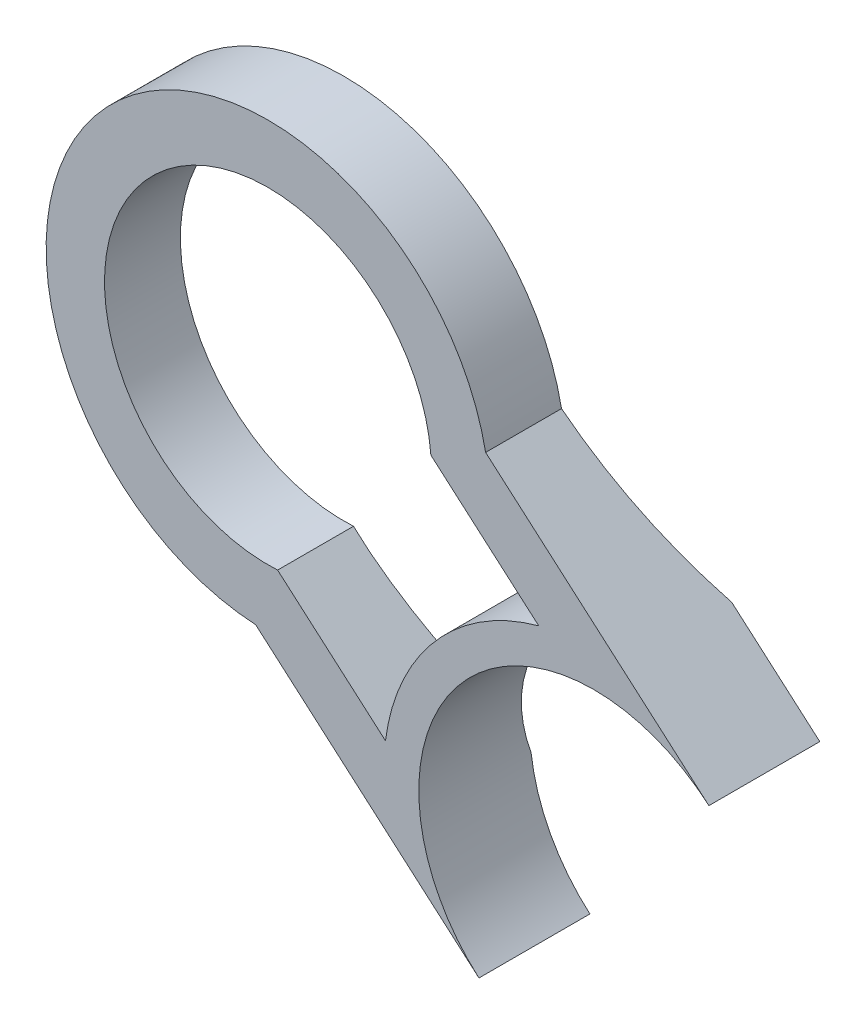
ISO-10303-21;
HEADER;
FILE_DESCRIPTION(('STEP AP214'),'2;1');
FILE_NAME('part.step','',(''),(''),'','','');
FILE_SCHEMA(('AUTOMOTIVE_DESIGN { 1 0 10303 214 1 1 1 1 }'));
ENDSEC;
DATA;
#1=APPLICATION_CONTEXT('core data for automotive mechanical design processes');
#2=APPLICATION_PROTOCOL_DEFINITION('international standard','automotive_design',2000,#1);
#3=PRODUCT_CONTEXT('',#1,'mechanical');
#4=PRODUCT('Part','Part','',(#3));
#5=PRODUCT_RELATED_PRODUCT_CATEGORY('part','',(#4));
#6=PRODUCT_DEFINITION_FORMATION('','',#4);
#7=PRODUCT_DEFINITION_CONTEXT('part definition',#1,'design');
#8=PRODUCT_DEFINITION('design','',#6,#7);
#9=PRODUCT_DEFINITION_SHAPE('','',#8);
#10=(LENGTH_UNIT() NAMED_UNIT(*) SI_UNIT(.MILLI.,.METRE.));
#11=(NAMED_UNIT(*) PLANE_ANGLE_UNIT() SI_UNIT($,.RADIAN.));
#12=(NAMED_UNIT(*) SI_UNIT($,.STERADIAN.) SOLID_ANGLE_UNIT());
#13=UNCERTAINTY_MEASURE_WITH_UNIT(LENGTH_MEASURE(1.E-05),#10,'distance_accuracy_value','');
#14=(GEOMETRIC_REPRESENTATION_CONTEXT(3) GLOBAL_UNCERTAINTY_ASSIGNED_CONTEXT((#13)) GLOBAL_UNIT_ASSIGNED_CONTEXT((#10,
#11,#12)) REPRESENTATION_CONTEXT('',''));
#15=CARTESIAN_POINT('',(0.,0.,0.));
#16=DIRECTION('',(0.,0.,1.));
#17=DIRECTION('',(1.,0.,0.));
#18=AXIS2_PLACEMENT_3D('',#15,#16,#17);
#19=CARTESIAN_POINT('',(-302.446135350573,188.678257863986,0.));
#20=DIRECTION('',(0.,0.,1.));
#21=DIRECTION('',(1.,0.,0.));
#22=AXIS2_PLACEMENT_3D('',#19,#20,#21);
#23=PLANE('',#22);
#24=DIRECTION('',(0.754380739835842,-0.656437125218195,0.));
#25=VECTOR('',#24,1.);
#26=CARTESIAN_POINT('',(-304.544217889635,150.736222472361,0.));
#27=LINE('',#26,#25);
#28=CARTESIAN_POINT('',(-281.385737412899,130.584480061919,0.));
#29=VERTEX_POINT('',#28);
#30=CARTESIAN_POINT('',(-266.298122616176,117.45573755755,0.));
#31=VERTEX_POINT('',#30);
#32=EDGE_CURVE('E214',#29,#31,#27,.T.);
#33=ORIENTED_EDGE('',*,*,#32,.F.);
#34=DIRECTION('',(0.656437125218195,0.754380739835841,0.));
#35=VECTOR('',#34,1.);
#36=CARTESIAN_POINT('',(-313.33683528877,93.8661228450643,0.));
#37=LINE('',#36,#35);
#38=CARTESIAN_POINT('',(-276.371004005775,136.347436105102,0.));
#39=VERTEX_POINT('',#38);
#40=EDGE_CURVE('E244',#29,#39,#37,.T.);
#41=ORIENTED_EDGE('',*,*,#40,.T.);
#42=CARTESIAN_POINT('',(-246.605008859633,140.087159752628,0.));
#43=DIRECTION('',(0.,0.,-1.));
#44=DIRECTION('',(1.,0.,0.));
#45=AXIS2_PLACEMENT_3D('',#42,#43,#44);
#46=CIRCLE('',#45,30.);
#47=EDGE_CURVE('E213',#31,#39,#46,.T.);
#48=ORIENTED_EDGE('',*,*,#47,.F.);
#49=EDGE_LOOP('',(#33,#41,#48));
#50=FACE_BOUND('',#49,.T.);
#51=ADVANCED_FACE('F33',(#50),#23,.F.);
#52=CARTESIAN_POINT('',(-302.446135350573,188.678257863986,19.));
#53=DIRECTION('',(0.,0.,1.));
#54=DIRECTION('',(1.,0.,0.));
#55=AXIS2_PLACEMENT_3D('',#52,#53,#54);
#56=PLANE('',#55);
#57=CARTESIAN_POINT('',(-302.446135350573,188.678257863986,19.));
#58=DIRECTION('',(0.,0.,1.));
#59=DIRECTION('',(1.,0.,0.));
#60=AXIS2_PLACEMENT_3D('',#57,#58,#59);
#61=CIRCLE('',#60,38.);
#62=CARTESIAN_POINT('',(-265.157990376498,195.999066862472,19.));
#63=VERTEX_POINT('',#62);
#64=CARTESIAN_POINT('',(-304.544217889635,150.736222472361,19.));
#65=VERTEX_POINT('',#64);
#66=EDGE_CURVE('E222',#63,#65,#61,.T.);
#67=ORIENTED_EDGE('',*,*,#66,.T.);
#68=DIRECTION('',(0.754380739835842,-0.656437125218195,0.));
#69=VECTOR('',#68,1.);
#70=CARTESIAN_POINT('',(-304.544217889635,150.736222472361,19.));
#71=LINE('',#70,#69);
#72=CARTESIAN_POINT('',(-266.298122616176,117.45573755755,19.));
#73=VERTEX_POINT('',#72);
#74=EDGE_CURVE('E261',#65,#73,#71,.T.);
#75=ORIENTED_EDGE('',*,*,#74,.T.);
#76=CARTESIAN_POINT('',(-246.605008859633,140.087159752628,19.));
#77=DIRECTION('',(0.,0.,-1.));
#78=DIRECTION('',(1.,0.,0.));
#79=AXIS2_PLACEMENT_3D('',#76,#77,#78);
#80=CIRCLE('',#79,30.);
#81=CARTESIAN_POINT('',(-226.91189510309,162.718581947706,19.));
#82=VERTEX_POINT('',#81);
#83=EDGE_CURVE('E263',#73,#82,#80,.T.);
#84=ORIENTED_EDGE('',*,*,#83,.T.);
#85=DIRECTION('',(-0.754380739835842,0.656437125218195,0.));
#86=VECTOR('',#85,1.);
#87=CARTESIAN_POINT('',(-265.157990376498,195.999066862472,19.));
#88=LINE('',#87,#86);
#89=EDGE_CURVE('E226',#82,#63,#88,.T.);
#90=ORIENTED_EDGE('',*,*,#89,.T.);
#91=EDGE_LOOP('',(#67,#75,#84,#90));
#92=FACE_BOUND('',#91,.T.);
#93=DIRECTION('',(0.754380739835842,-0.656437125218195,0.));
#94=VECTOR('',#93,1.);
#95=CARTESIAN_POINT('',(-300.792094779922,160.727155027234,19.));
#96=LINE('',#95,#94);
#97=CARTESIAN_POINT('',(-300.792094779922,160.727155027234,19.));
#98=VERTEX_POINT('',#97);
#99=CARTESIAN_POINT('',(-282.314825505171,144.648847504114,19.));
#100=VERTEX_POINT('',#99);
#101=EDGE_CURVE('E281',#98,#100,#96,.T.);
#102=ORIENTED_EDGE('',*,*,#101,.F.);
#103=CARTESIAN_POINT('',(-302.446135350573,188.678257863986,19.));
#104=DIRECTION('',(0.,0.,1.));
#105=DIRECTION('',(1.,0.,0.));
#106=AXIS2_PLACEMENT_3D('',#103,#104,#105);
#107=CIRCLE('',#106,28.);
#108=CARTESIAN_POINT('',(-274.534609771158,190.902384620636,19.));
#109=VERTEX_POINT('',#108);
#110=EDGE_CURVE('E132',#109,#98,#107,.T.);
#111=ORIENTED_EDGE('',*,*,#110,.F.);
#112=DIRECTION('',(-0.754380739835842,0.656437125218194,0.));
#113=VECTOR('',#112,1.);
#114=CARTESIAN_POINT('',(-274.534609771158,190.902384620636,19.));
#115=LINE('',#114,#113);
#116=CARTESIAN_POINT('',(-256.057340496444,174.824077097547,19.));
#117=VERTEX_POINT('',#116);
#118=EDGE_CURVE('E246',#117,#109,#115,.T.);
#119=ORIENTED_EDGE('',*,*,#118,.F.);
#120=CARTESIAN_POINT('',(-246.605008859633,140.087159752628,19.));
#121=DIRECTION('',(0.,0.,-1.));
#122=DIRECTION('',(1.,0.,0.));
#123=AXIS2_PLACEMENT_3D('',#120,#121,#122);
#124=CIRCLE('',#123,36.);
#125=EDGE_CURVE('E252',#100,#117,#124,.T.);
#126=ORIENTED_EDGE('',*,*,#125,.F.);
#127=EDGE_LOOP('',(#102,#111,#119,#126));
#128=FACE_BOUND('',#127,.T.);
#129=ADVANCED_FACE('F193',(#92,#128),#56,.T.);
#130=CARTESIAN_POINT('',(-247.014243306931,170.084368408887,0.));
#131=VERTEX_POINT('',#130);
#132=CARTESIAN_POINT('',(-226.91189510309,162.718581947706,0.));
#133=VERTEX_POINT('',#132);
#134=EDGE_CURVE('E208',#131,#133,#46,.T.);
#135=ORIENTED_EDGE('',*,*,#134,.F.);
#136=CARTESIAN_POINT('',(-241.999509899807,175.84732445207,0.));
#137=VERTEX_POINT('',#136);
#138=EDGE_CURVE('E138',#131,#137,#37,.T.);
#139=ORIENTED_EDGE('',*,*,#138,.T.);
#140=DIRECTION('',(-0.754380739835842,0.656437125218195,0.));
#141=VECTOR('',#140,1.);
#142=CARTESIAN_POINT('',(-265.157990376498,195.999066862472,0.));
#143=LINE('',#142,#141);
#144=EDGE_CURVE('E210',#133,#137,#143,.T.);
#145=ORIENTED_EDGE('',*,*,#144,.F.);
#146=EDGE_LOOP('',(#135,#139,#145));
#147=FACE_BOUND('',#146,.T.);
#148=ADVANCED_FACE('F191',(#147),#23,.F.);
#149=CARTESIAN_POINT('',(-302.446135350573,188.678257863986,19.));
#150=DIRECTION('',(0.,0.,-1.));
#151=DIRECTION('',(-1.,0.,0.));
#152=AXIS2_PLACEMENT_3D('',#149,#150,#151);
#153=CYLINDRICAL_SURFACE('',#152,38.);
#154=DIRECTION('',(0.,0.,-1.));
#155=VECTOR('',#154,1.);
#156=CARTESIAN_POINT('',(-265.157990376498,195.999066862472,19.));
#157=LINE('',#156,#155);
#158=CARTESIAN_POINT('',(-265.157990376498,195.999066862472,5.99910467004484));
#159=VERTEX_POINT('',#158);
#160=EDGE_CURVE('E223',#63,#159,#157,.T.);
#161=ORIENTED_EDGE('',*,*,#160,.T.);
#162=CARTESIAN_POINT('',(-265.157990376498,195.999066862472,5.99910467004484));
#163=CARTESIAN_POINT('',(-265.15900618024,196.004240803965,5.99925436425014));
#164=CARTESIAN_POINT('',(-265.160023062062,196.009414540147,5.99940382218238));
#165=CARTESIAN_POINT('',(-265.162058981863,196.019761601889,5.99970226550077));
#166=CARTESIAN_POINT('',(-265.163078019842,196.024934927448,5.99985125088691));
#167=CARTESIAN_POINT('',(-265.1640981359,196.030108047697,6.00000000000001));
#168=B_SPLINE_CURVE_WITH_KNOTS('',3,(#162,#163,#164,#165,#166,#167),.UNSPECIFIED.,.F.,.F.,(4,2,
4),(0.,0.0158245186830743,0.0316490373661981),.UNSPECIFIED.);
#169=CARTESIAN_POINT('',(-265.1640981359,196.030108047697,6.));
#170=VERTEX_POINT('',#169);
#171=EDGE_CURVE('E49',#159,#170,#168,.T.);
#172=ORIENTED_EDGE('',*,*,#171,.T.);
#173=CARTESIAN_POINT('',(-302.446135350573,188.678257863986,6.));
#174=DIRECTION('',(0.,0.,1.));
#175=DIRECTION('',(1.,0.,0.));
#176=AXIS2_PLACEMENT_3D('',#173,#174,#175);
#177=CIRCLE('',#176,38.);
#178=CARTESIAN_POINT('',(-304.575805272061,150.73798235068,6.));
#179=VERTEX_POINT('',#178);
#180=EDGE_CURVE('E135',#170,#179,#177,.T.);
#181=ORIENTED_EDGE('',*,*,#180,.T.);
#182=CARTESIAN_POINT('',(-304.575805272061,150.73798235068,6.00000000000001));
#183=CARTESIAN_POINT('',(-304.570540817068,150.737686845414,5.99985125088729));
#184=CARTESIAN_POINT('',(-304.565276307702,150.737392436254,5.99970226550151));
#185=CARTESIAN_POINT('',(-304.554747180227,150.736805810147,5.99940382218386));
#186=CARTESIAN_POINT('',(-304.549482562117,150.736513593201,5.99925436425197));
#187=CARTESIAN_POINT('',(-304.544217889635,150.736222472361,5.99910467004704));
#188=B_SPLINE_CURVE_WITH_KNOTS('',3,(#182,#183,#184,#185,#186,#187),.UNSPECIFIED.,.F.,.F.,(4,2,
4),(0.,0.0158245186443797,0.0316490372887707),.UNSPECIFIED.);
#189=CARTESIAN_POINT('',(-304.544217889635,150.736222472361,5.99910467004704));
#190=VERTEX_POINT('',#189);
#191=EDGE_CURVE('E121',#179,#190,#188,.T.);
#192=ORIENTED_EDGE('',*,*,#191,.T.);
#193=DIRECTION('',(0.,0.,-1.));
#194=VECTOR('',#193,1.);
#195=CARTESIAN_POINT('',(-304.544217889635,150.736222472361,19.));
#196=LINE('',#195,#194);
#197=EDGE_CURVE('E231',#65,#190,#196,.T.);
#198=ORIENTED_EDGE('',*,*,#197,.F.);
#199=ORIENTED_EDGE('',*,*,#66,.F.);
#200=EDGE_LOOP('',(#161,#172,#181,#192,#198,#199));
#201=FACE_BOUND('',#200,.T.);
#202=ADVANCED_FACE('F35',(#201),#153,.T.);
#203=CARTESIAN_POINT('',(-304.544217889635,150.736222472361,19.));
#204=DIRECTION('',(0.656437125218195,0.754380739835842,0.));
#205=DIRECTION('',(-0.754380739835842,0.656437125218195,0.));
#206=AXIS2_PLACEMENT_3D('',#203,#204,#205);
#207=PLANE('',#206);
#208=ORIENTED_EDGE('',*,*,#197,.T.);
#209=CARTESIAN_POINT('',(-307.255298760397,153.09531522097,-93.9362980755048));
#210=DIRECTION('',(0.656437125218195,0.754380739835842,0.));
#211=DIRECTION('',(-0.754380739835842,0.656437125218195,0.));
#212=AXIS2_PLACEMENT_3D('',#209,#210,#211);
#213=CIRCLE('',#212,100.);
#214=EDGE_CURVE('E127',#190,#29,#213,.T.);
#215=ORIENTED_EDGE('',*,*,#214,.T.);
#216=ORIENTED_EDGE('',*,*,#32,.T.);
#217=DIRECTION('',(0.,0.,-1.));
#218=VECTOR('',#217,1.);
#219=CARTESIAN_POINT('',(-266.298122616176,117.45573755755,19.));
#220=LINE('',#219,#218);
#221=EDGE_CURVE('E228',#73,#31,#220,.T.);
#222=ORIENTED_EDGE('',*,*,#221,.F.);
#223=ORIENTED_EDGE('',*,*,#74,.F.);
#224=EDGE_LOOP('',(#208,#215,#216,#222,#223));
#225=FACE_BOUND('',#224,.T.);
#226=ADVANCED_FACE('F183',(#225),#207,.F.);
#227=CARTESIAN_POINT('',(-246.605008859633,140.087159752628,19.));
#228=DIRECTION('',(0.,0.,-1.));
#229=DIRECTION('',(-1.,0.,0.));
#230=AXIS2_PLACEMENT_3D('',#227,#228,#229);
#231=CYLINDRICAL_SURFACE('',#230,30.);
#232=ORIENTED_EDGE('',*,*,#47,.T.);
#233=CARTESIAN_POINT('',(-276.371004005775,136.347436105102,0.));
#234=CARTESIAN_POINT('',(-276.420404068987,136.740570521399,0.107816812486937));
#235=CARTESIAN_POINT('',(-276.462110881207,137.135563648663,0.212378324183237));
#236=CARTESIAN_POINT('',(-276.529890759937,137.928530972936,0.415086595254615));
#237=CARTESIAN_POINT('',(-276.55596362865,138.326505207597,0.513233273456679));
#238=CARTESIAN_POINT('',(-276.592227367026,139.124693975806,0.703206328310026));
#239=CARTESIAN_POINT('',(-276.60241801517,139.524908540524,0.795032616789777));
#240=CARTESIAN_POINT('',(-276.606732212244,140.326768331182,0.972471284890888));
#241=CARTESIAN_POINT('',(-276.600855855945,140.72841354867,1.05808370116089));
#242=CARTESIAN_POINT('',(-276.558901548872,141.933779549287,1.30567028952324));
#243=CARTESIAN_POINT('',(-276.498532989239,142.738681914317,1.45857145547387));
#244=CARTESIAN_POINT('',(-276.312348417463,144.344837811838,1.74118617700598));
#245=CARTESIAN_POINT('',(-276.186534968094,145.146091485971,1.87090064029396));
#246=CARTESIAN_POINT('',(-275.869419628533,146.739577784972,2.10852354954709));
#247=CARTESIAN_POINT('',(-275.678061521042,147.531802060678,2.21641314967685));
#248=CARTESIAN_POINT('',(-275.230644798505,149.100382853274,2.41149119947145));
#249=CARTESIAN_POINT('',(-274.974584609877,149.876738983748,2.49867914556336));
#250=CARTESIAN_POINT('',(-274.399247898372,151.407433870058,2.65350636593513));
#251=CARTESIAN_POINT('',(-274.079988197619,152.16177842365,2.7211508304406));
#252=CARTESIAN_POINT('',(-273.380201401439,153.642969306922,2.83794284262997));
#253=CARTESIAN_POINT('',(-272.999674999074,154.369815947551,2.88709059953158));
#254=CARTESIAN_POINT('',(-272.182046972452,155.786864634177,2.96748621888479));
#255=CARTESIAN_POINT('',(-271.745254574649,156.477239852892,2.99882719416758));
#256=CARTESIAN_POINT('',(-270.816524705123,157.820438673348,3.04454946092529));
#257=CARTESIAN_POINT('',(-270.324587250293,158.473262286592,3.0589307575954));
#258=CARTESIAN_POINT('',(-269.288926561116,159.736771362618,3.07099112969979));
#259=CARTESIAN_POINT('',(-268.745195977046,160.347450823652,3.06866783116808));
#260=CARTESIAN_POINT('',(-267.609871433367,161.52224836747,3.04727160736631));
#261=CARTESIAN_POINT('',(-267.018277531021,162.086366505957,3.02819870213494));
#262=CARTESIAN_POINT('',(-265.790765794939,163.16474494289,2.97293231844578));
#263=CARTESIAN_POINT('',(-265.154796171933,163.678945252966,2.93671854064228));
#264=CARTESIAN_POINT('',(-263.843825751209,164.653196141764,2.84654389828636));
#265=CARTESIAN_POINT('',(-263.168824602583,165.113246233542,2.79258287415924));
#266=CARTESIAN_POINT('',(-261.7846444641,165.976231099445,2.66603333383554));
#267=CARTESIAN_POINT('',(-261.075455984382,166.379149891069,2.59343962103587));
#268=CARTESIAN_POINT('',(-259.628491065014,167.125122267381,2.42857674490282));
#269=CARTESIAN_POINT('',(-258.890715708656,167.468178117855,2.33630832654201));
#270=CARTESIAN_POINT('',(-257.392576936693,168.092276694933,2.13095166004637));
#271=CARTESIAN_POINT('',(-256.632223479261,168.373346313104,2.01787247948555));
#272=CARTESIAN_POINT('',(-255.094446668196,168.872275813097,1.76960606610792));
#273=CARTESIAN_POINT('',(-254.317020912907,169.09012673952,1.63441570531483));
#274=CARTESIAN_POINT('',(-252.752683098649,169.461492268848,1.34098240453188));
#275=CARTESIAN_POINT('',(-251.965788952377,169.615113191806,1.18277814945151));
#276=CARTESIAN_POINT('',(-250.387733901849,169.858416378688,0.842114054314688));
#277=CARTESIAN_POINT('',(-249.59657566467,169.948134782753,0.659667993629153));
#278=CARTESIAN_POINT('',(-248.507088354589,170.028307681825,0.390824807373272));
#279=CARTESIAN_POINT('',(-248.20788182976,170.045804318502,0.315157673626885));
#280=CARTESIAN_POINT('',(-247.610396330268,170.07179652638,0.160272287439845));
#281=CARTESIAN_POINT('',(-247.312116664073,170.08030330195,0.0810585839329725));
#282=CARTESIAN_POINT('',(-247.014243306931,170.084368408887,0.));
#283=B_SPLINE_CURVE_WITH_KNOTS('',3,(#233,#234,#235,#236,#237,#238,#239,#240,#241,#242,#243,
#244,#245,#246,#247,#248,#249,#250,#251,#252,#253,#254,#255,#256,#257,#258,#259,#260,#261,#262,
#263,#264,#265,#266,#267,#268,#269,#270,#271,#272,#273,#274,#275,#276,#277,#278,#279,#280,#281,
#282),.UNSPECIFIED.,.F.,.F.,(4,2,2,2,2,2,2,2,2,2,2,2,2,2,2,2,2,2,2,2,2,2,2,2,4),(0.,
1.23180744057999,2.46363046537952,3.69547067103728,4.92730361086463,7.3886586699541,
9.8499173514953,12.3132923494452,14.7767272634723,17.2395073524875,19.7022595839677,
22.1520125149122,24.6017646954344,27.0518650282611,29.5019624298692,31.9549686851669,
34.4079969973176,36.861710196781,39.3153305041554,41.7678842511226,44.2207852511904,
46.6696097287165,49.1170481687683,50.0442955879666,50.9703859794601),.UNSPECIFIED.);
#284=EDGE_CURVE('E171',#39,#131,#283,.T.);
#285=ORIENTED_EDGE('',*,*,#284,.T.);
#286=ORIENTED_EDGE('',*,*,#134,.T.);
#287=DIRECTION('',(0.,0.,-1.));
#288=VECTOR('',#287,1.);
#289=CARTESIAN_POINT('',(-226.91189510309,162.718581947706,19.));
#290=LINE('',#289,#288);
#291=EDGE_CURVE('E225',#82,#133,#290,.T.);
#292=ORIENTED_EDGE('',*,*,#291,.F.);
#293=ORIENTED_EDGE('',*,*,#83,.F.);
#294=ORIENTED_EDGE('',*,*,#221,.T.);
#295=EDGE_LOOP('',(#232,#285,#286,#292,#293,#294));
#296=FACE_BOUND('',#295,.T.);
#297=ADVANCED_FACE('F178',(#296),#231,.F.);
#298=CARTESIAN_POINT('',(-265.157990376498,195.999066862472,19.));
#299=DIRECTION('',(-0.656437125218195,-0.754380739835842,0.));
#300=DIRECTION('',(0.754380739835842,-0.656437125218195,0.));
#301=AXIS2_PLACEMENT_3D('',#298,#299,#300);
#302=PLANE('',#301);
#303=ORIENTED_EDGE('',*,*,#144,.T.);
#304=CARTESIAN_POINT('',(-267.869071247305,198.35815961112,-93.9362980755048));
#305=DIRECTION('',(-0.656437125218195,-0.754380739835842,0.));
#306=DIRECTION('',(0.754380739835842,-0.656437125218195,0.));
#307=AXIS2_PLACEMENT_3D('',#304,#305,#306);
#308=CIRCLE('',#307,100.);
#309=EDGE_CURVE('E270',#137,#159,#308,.T.);
#310=ORIENTED_EDGE('',*,*,#309,.T.);
#311=ORIENTED_EDGE('',*,*,#160,.F.);
#312=ORIENTED_EDGE('',*,*,#89,.F.);
#313=ORIENTED_EDGE('',*,*,#291,.T.);
#314=EDGE_LOOP('',(#303,#310,#311,#312,#313));
#315=FACE_BOUND('',#314,.T.);
#316=ADVANCED_FACE('F182',(#315),#302,.F.);
#317=CARTESIAN_POINT('',(-302.446135350573,188.678257863986,19.));
#318=DIRECTION('',(0.,0.,-1.));
#319=DIRECTION('',(-1.,0.,0.));
#320=AXIS2_PLACEMENT_3D('',#317,#318,#319);
#321=CYLINDRICAL_SURFACE('',#320,28.);
#322=CARTESIAN_POINT('',(-302.446135350573,188.678257863986,6.));
#323=DIRECTION('',(0.,0.,1.));
#324=DIRECTION('',(1.,0.,0.));
#325=AXIS2_PLACEMENT_3D('',#322,#323,#324);
#326=CIRCLE('',#325,28.);
#327=CARTESIAN_POINT('',(-274.534609771158,190.902384620636,6.));
#328=VERTEX_POINT('',#327);
#329=CARTESIAN_POINT('',(-300.792094779922,160.727155027234,6.));
#330=VERTEX_POINT('',#329);
#331=EDGE_CURVE('E145',#328,#330,#326,.T.);
#332=ORIENTED_EDGE('',*,*,#331,.F.);
#333=DIRECTION('',(0.,0.,-1.));
#334=VECTOR('',#333,1.);
#335=CARTESIAN_POINT('',(-274.534609771158,190.902384620636,19.));
#336=LINE('',#335,#334);
#337=EDGE_CURVE('E241',#109,#328,#336,.T.);
#338=ORIENTED_EDGE('',*,*,#337,.F.);
#339=ORIENTED_EDGE('',*,*,#110,.T.);
#340=DIRECTION('',(0.,0.,-1.));
#341=VECTOR('',#340,1.);
#342=CARTESIAN_POINT('',(-300.792094779922,160.727155027234,19.));
#343=LINE('',#342,#341);
#344=EDGE_CURVE('E217',#98,#330,#343,.T.);
#345=ORIENTED_EDGE('',*,*,#344,.T.);
#346=EDGE_LOOP('',(#332,#338,#339,#345));
#347=FACE_BOUND('',#346,.T.);
#348=ADVANCED_FACE('F240',(#347),#321,.F.);
#349=CARTESIAN_POINT('',(-300.792094779922,160.727155027234,19.));
#350=DIRECTION('',(0.656437125218195,0.754380739835842,0.));
#351=DIRECTION('',(-0.754380739835842,0.656437125218195,0.));
#352=AXIS2_PLACEMENT_3D('',#349,#350,#351);
#353=PLANE('',#352);
#354=CARTESIAN_POINT('',(-300.690927508215,160.639122619328,-93.9362980755048));
#355=DIRECTION('',(0.656437125218195,0.754380739835842,0.));
#356=DIRECTION('',(-0.754380739835842,0.656437125218195,0.));
#357=AXIS2_PLACEMENT_3D('',#354,#355,#356);
#358=CIRCLE('',#357,100.);
#359=CARTESIAN_POINT('',(-297.99869420836,158.296430402454,6.));
#360=VERTEX_POINT('',#359);
#361=CARTESIAN_POINT('',(-282.314825505171,144.648847504114,3.05148454124279));
#362=VERTEX_POINT('',#361);
#363=EDGE_CURVE('E143',#360,#362,#358,.T.);
#364=ORIENTED_EDGE('',*,*,#363,.F.);
#365=DIRECTION('',(0.754380739835842,-0.656437125218195,0.));
#366=VECTOR('',#365,1.);
#367=CARTESIAN_POINT('',(-300.792094779922,160.727155027234,6.));
#368=LINE('',#367,#366);
#369=EDGE_CURVE('E137',#330,#360,#368,.T.);
#370=ORIENTED_EDGE('',*,*,#369,.F.);
#371=ORIENTED_EDGE('',*,*,#344,.F.);
#372=ORIENTED_EDGE('',*,*,#101,.T.);
#373=DIRECTION('',(0.,0.,-1.));
#374=VECTOR('',#373,1.);
#375=CARTESIAN_POINT('',(-282.314825505171,144.648847504114,19.));
#376=LINE('',#375,#374);
#377=EDGE_CURVE('E250',#100,#362,#376,.T.);
#378=ORIENTED_EDGE('',*,*,#377,.T.);
#379=EDGE_LOOP('',(#364,#370,#371,#372,#378));
#380=FACE_BOUND('',#379,.T.);
#381=ADVANCED_FACE('F288',(#380),#353,.T.);
#382=CARTESIAN_POINT('',(-246.605008859633,140.087159752628,19.));
#383=DIRECTION('',(0.,0.,-1.));
#384=DIRECTION('',(-1.,0.,0.));
#385=AXIS2_PLACEMENT_3D('',#382,#383,#384);
#386=CYLINDRICAL_SURFACE('',#385,36.);
#387=CARTESIAN_POINT('',(-282.314825505171,144.648847504114,3.05148454124279));
#388=CARTESIAN_POINT('',(-282.252690647393,145.13532021141,3.11991375546108));
#389=CARTESIAN_POINT('',(-282.180541224999,145.620964543925,3.18509318641947));
#390=CARTESIAN_POINT('',(-282.016287695116,146.589659856878,3.30924582388755));
#391=CARTESIAN_POINT('',(-281.924183805454,147.072710865565,3.36821909813454));
#392=CARTESIAN_POINT('',(-281.720105445487,148.035241613711,3.48024819586014));
#393=CARTESIAN_POINT('',(-281.608133122121,148.514721733204,3.53330465768868));
#394=CARTESIAN_POINT('',(-281.364466936414,149.469204880493,3.6337893074208));
#395=CARTESIAN_POINT('',(-281.232773057065,149.944207904426,3.68121749047046));
#396=CARTESIAN_POINT('',(-280.808618165697,151.360267735096,3.81539305866127));
#397=CARTESIAN_POINT('',(-280.486845742034,152.293499231394,3.89416048072073));
#398=CARTESIAN_POINT('',(-279.767211772547,154.131472226265,4.03236678578825));
#399=CARTESIAN_POINT('',(-279.369350078363,155.036213669284,4.09180563110883));
#400=CARTESIAN_POINT('',(-278.500064774102,156.810844308492,4.19307919261234));
#401=CARTESIAN_POINT('',(-278.028631702664,157.680729003956,4.23491164203169));
#402=CARTESIAN_POINT('',(-277.01545260431,159.379200286537,4.30225681299821));
#403=CARTESIAN_POINT('',(-276.473705761457,160.20778639426,4.32776934514497));
#404=CARTESIAN_POINT('',(-275.323614461152,161.817793371388,4.36331331601164));
#405=CARTESIAN_POINT('',(-274.715266434967,162.599211709887,4.37334392471852));
#406=CARTESIAN_POINT('',(-273.43626028841,164.109295102674,4.37826010131999));
#407=CARTESIAN_POINT('',(-272.765603374181,164.837961177627,4.37314596231977));
#408=CARTESIAN_POINT('',(-271.363148831228,166.240999604469,4.34753533447798));
#409=CARTESIAN_POINT('',(-270.631058365937,166.915077852105,4.32696096253735));
#410=CARTESIAN_POINT('',(-269.113902208389,168.200110716841,4.26964531430273));
#411=CARTESIAN_POINT('',(-268.328832169123,168.811060143744,4.23290271002563));
#412=CARTESIAN_POINT('',(-266.711996279832,169.965164397621,4.14210250609647));
#413=CARTESIAN_POINT('',(-265.880257065729,170.508357336578,4.08805470193852));
#414=CARTESIAN_POINT('',(-264.175972971194,171.523513350112,3.96103816246416));
#415=CARTESIAN_POINT('',(-263.303440708014,171.995498260832,3.8880752462531));
#416=CARTESIAN_POINT('',(-261.902794592892,172.680130853179,3.75677149334598));
#417=CARTESIAN_POINT('',(-261.386042958725,172.917694961812,3.70541176909585));
#418=CARTESIAN_POINT('',(-260.34254117269,173.367829114353,3.59538350551412));
#419=CARTESIAN_POINT('',(-259.815791910021,173.580401369073,3.53671561361983));
#420=CARTESIAN_POINT('',(-258.75458171227,173.979764941106,3.41174933420242));
#421=CARTESIAN_POINT('',(-258.220136017955,174.166601070065,3.34546458803141));
#422=CARTESIAN_POINT('',(-257.143882675437,174.514654149743,3.20471789072638));
#423=CARTESIAN_POINT('',(-256.602073268002,174.675864857323,3.13025395433973));
#424=CARTESIAN_POINT('',(-256.057340496444,174.824077097547,3.05148454124279));
#425=B_SPLINE_CURVE_WITH_KNOTS('',3,(#387,#388,#389,#390,#391,#392,#393,#394,#395,#396,#397,
#398,#399,#400,#401,#402,#403,#404,#405,#406,#407,#408,#409,#410,#411,#412,#413,#414,#415,#416,
#417,#418,#419,#420,#421,#422,#423,#424),.UNSPECIFIED.,.F.,.F.,(4,2,2,2,2,2,2,2,2,2,2,2,2,2,2,2,
2,2,4),(0.,1.4854035761468,2.97079093812638,4.4560178900654,5.94124612287713,8.90824539603867,
11.8752504543156,14.842637387639,17.8100587582772,20.7776392120457,23.7451622328624,
26.7277356366941,29.7105540609184,32.6916870565252,35.6719040129861,37.3844874569357,
39.0969192892988,40.8063306975441,42.5161579347279),.UNSPECIFIED.);
#426=CARTESIAN_POINT('',(-256.057340496444,174.824077097547,3.05148454124281));
#427=VERTEX_POINT('',#426);
#428=EDGE_CURVE('E141',#362,#427,#425,.T.);
#429=ORIENTED_EDGE('',*,*,#428,.F.);
#430=ORIENTED_EDGE('',*,*,#377,.F.);
#431=ORIENTED_EDGE('',*,*,#125,.T.);
#432=DIRECTION('',(0.,0.,-1.));
#433=VECTOR('',#432,1.);
#434=CARTESIAN_POINT('',(-256.057340496444,174.824077097547,19.));
#435=LINE('',#434,#433);
#436=EDGE_CURVE('E247',#117,#427,#435,.T.);
#437=ORIENTED_EDGE('',*,*,#436,.T.);
#438=EDGE_LOOP('',(#429,#430,#431,#437));
#439=FACE_BOUND('',#438,.T.);
#440=ADVANCED_FACE('F155',(#439),#386,.T.);
#441=CARTESIAN_POINT('',(-274.534609771158,190.902384620636,19.));
#442=DIRECTION('',(-0.656437125218194,-0.754380739835842,0.));
#443=DIRECTION('',(0.754380739835842,-0.656437125218194,0.));
#444=AXIS2_PLACEMENT_3D('',#441,#442,#443);
#445=PLANE('',#444);
#446=CARTESIAN_POINT('',(-274.433442499487,190.814352212762,-93.9362980755048));
#447=DIRECTION('',(-0.656437125218194,-0.754380739835842,0.));
#448=DIRECTION('',(0.754380739835842,-0.656437125218194,0.));
#449=AXIS2_PLACEMENT_3D('',#446,#447,#448);
#450=CIRCLE('',#449,100.);
#451=CARTESIAN_POINT('',(-271.741209199632,188.471659995887,6.));
#452=VERTEX_POINT('',#451);
#453=EDGE_CURVE('E11',#427,#452,#450,.T.);
#454=ORIENTED_EDGE('',*,*,#453,.F.);
#455=ORIENTED_EDGE('',*,*,#436,.F.);
#456=ORIENTED_EDGE('',*,*,#118,.T.);
#457=ORIENTED_EDGE('',*,*,#337,.T.);
#458=DIRECTION('',(-0.754380739835842,0.656437125218194,0.));
#459=VECTOR('',#458,1.);
#460=CARTESIAN_POINT('',(-274.534609771158,190.902384620636,6.));
#461=LINE('',#460,#459);
#462=EDGE_CURVE('E42',#452,#328,#461,.T.);
#463=ORIENTED_EDGE('',*,*,#462,.F.);
#464=EDGE_LOOP('',(#454,#455,#456,#457,#463));
#465=FACE_BOUND('',#464,.T.);
#466=ADVANCED_FACE('F162',(#465),#445,.T.);
#467=CARTESIAN_POINT('',(-339.206396636268,116.376958004115,-93.9362980755048));
#468=DIRECTION('',(0.656437125218195,0.754380739835841,0.));
#469=DIRECTION('',(-0.754380739835841,0.656437125218195,0.));
#470=AXIS2_PLACEMENT_3D('',#467,#468,#469);
#471=CYLINDRICAL_SURFACE('',#470,100.);
#472=DIRECTION('',(0.656437125218195,0.754380739835841,0.));
#473=VECTOR('',#472,1.);
#474=CARTESIAN_POINT('',(-336.514163336413,114.034265787241,6.00000000000001));
#475=LINE('',#474,#473);
#476=EDGE_CURVE('E124',#179,#360,#475,.T.);
#477=ORIENTED_EDGE('',*,*,#476,.T.);
#478=ORIENTED_EDGE('',*,*,#363,.T.);
#479=ORIENTED_EDGE('',*,*,#428,.T.);
#480=ORIENTED_EDGE('',*,*,#453,.T.);
#481=EDGE_CURVE('E56',#452,#170,#475,.T.);
#482=ORIENTED_EDGE('',*,*,#481,.T.);
#483=ORIENTED_EDGE('',*,*,#171,.F.);
#484=ORIENTED_EDGE('',*,*,#309,.F.);
#485=ORIENTED_EDGE('',*,*,#138,.F.);
#486=ORIENTED_EDGE('',*,*,#284,.F.);
#487=ORIENTED_EDGE('',*,*,#40,.F.);
#488=ORIENTED_EDGE('',*,*,#214,.F.);
#489=ORIENTED_EDGE('',*,*,#191,.F.);
#490=EDGE_LOOP('',(#477,#478,#479,#480,#482,#483,#484,#485,#486,#487,#488,#489));
#491=FACE_BOUND('',#490,.T.);
#492=ADVANCED_FACE('F123',(#491),#471,.F.);
#493=CARTESIAN_POINT('',(-395.589894982484,165.440010133719,6.));
#494=DIRECTION('',(0.,0.,1.));
#495=DIRECTION('',(1.,0.,0.));
#496=AXIS2_PLACEMENT_3D('',#493,#494,#495);
#497=PLANE('',#496);
#498=ORIENTED_EDGE('',*,*,#481,.F.);
#499=ORIENTED_EDGE('',*,*,#462,.T.);
#500=ORIENTED_EDGE('',*,*,#331,.T.);
#501=ORIENTED_EDGE('',*,*,#369,.T.);
#502=ORIENTED_EDGE('',*,*,#476,.F.);
#503=ORIENTED_EDGE('',*,*,#180,.F.);
#504=EDGE_LOOP('',(#498,#499,#500,#501,#502,#503));
#505=FACE_BOUND('',#504,.T.);
#506=ADVANCED_FACE('F134',(#505),#497,.F.);
#507=CLOSED_SHELL('',(#51,#129,#148,#202,#226,#297,#316,#348,#381,#440,#466,#492,#506));
#508=MANIFOLD_SOLID_BREP('B2',#507);
#509=ADVANCED_BREP_SHAPE_REPRESENTATION('',(#18,#508),#14);
#510=SHAPE_DEFINITION_REPRESENTATION(#9,#509);
ENDSEC;
END-ISO-10303-21;
